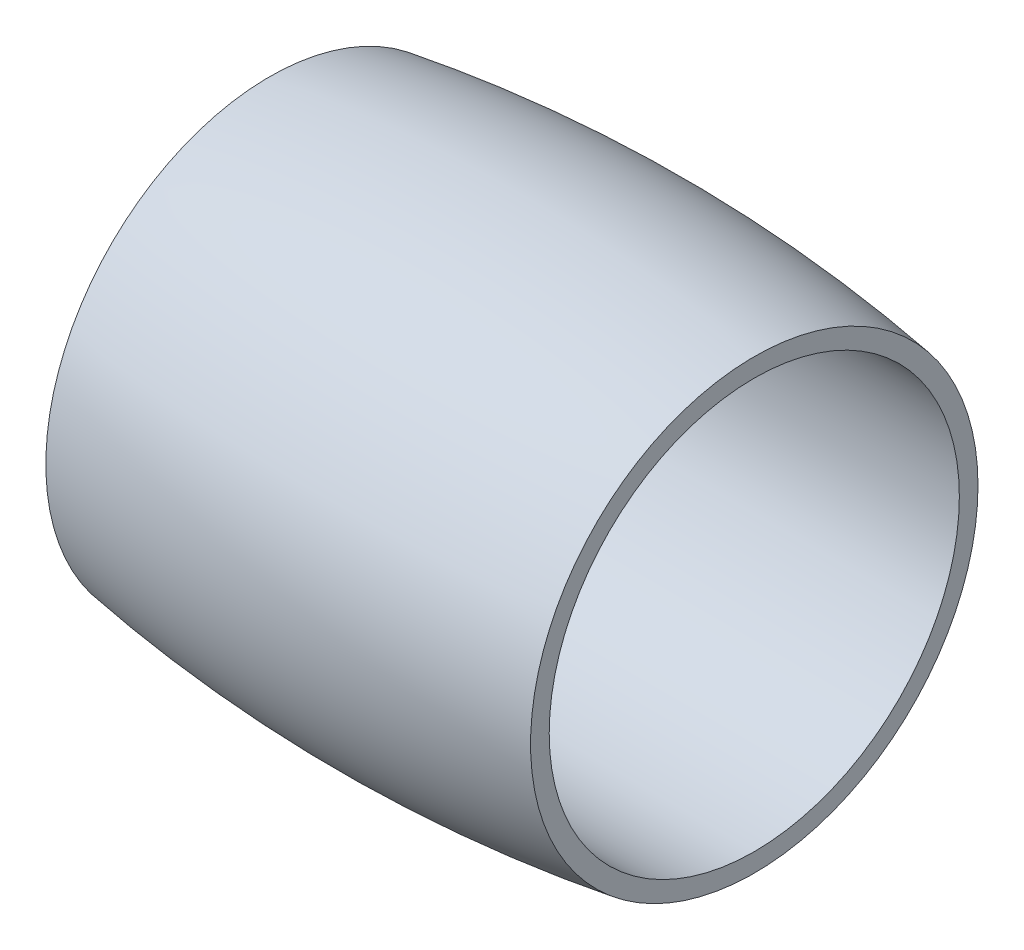
ISO-10303-21;
HEADER;
FILE_DESCRIPTION(('STEP AP214'),'2;1');
FILE_NAME('part.step','',(''),(''),'','','');
FILE_SCHEMA(('AUTOMOTIVE_DESIGN { 1 0 10303 214 1 1 1 1 }'));
ENDSEC;
DATA;
#1=APPLICATION_CONTEXT('core data for automotive mechanical design processes');
#2=APPLICATION_PROTOCOL_DEFINITION('international standard','automotive_design',2000,#1);
#3=PRODUCT_CONTEXT('',#1,'mechanical');
#4=PRODUCT('Part','Part','',(#3));
#5=PRODUCT_RELATED_PRODUCT_CATEGORY('part','',(#4));
#6=PRODUCT_DEFINITION_FORMATION('','',#4);
#7=PRODUCT_DEFINITION_CONTEXT('part definition',#1,'design');
#8=PRODUCT_DEFINITION('design','',#6,#7);
#9=PRODUCT_DEFINITION_SHAPE('','',#8);
#10=(LENGTH_UNIT() NAMED_UNIT(*) SI_UNIT(.MILLI.,.METRE.));
#11=(NAMED_UNIT(*) PLANE_ANGLE_UNIT() SI_UNIT($,.RADIAN.));
#12=(NAMED_UNIT(*) SI_UNIT($,.STERADIAN.) SOLID_ANGLE_UNIT());
#13=UNCERTAINTY_MEASURE_WITH_UNIT(LENGTH_MEASURE(1.E-05),#10,'distance_accuracy_value','');
#14=(GEOMETRIC_REPRESENTATION_CONTEXT(3) GLOBAL_UNCERTAINTY_ASSIGNED_CONTEXT((#13)) GLOBAL_UNIT_ASSIGNED_CONTEXT((#10,
#11,#12)) REPRESENTATION_CONTEXT('',''));
#15=CARTESIAN_POINT('',(0.,0.,0.));
#16=DIRECTION('',(0.,0.,1.));
#17=DIRECTION('',(1.,0.,0.));
#18=AXIS2_PLACEMENT_3D('',#15,#16,#17);
#19=CARTESIAN_POINT('',(-32.5,30.,0.));
#20=DIRECTION('',(-1.,0.,0.));
#21=DIRECTION('',(0.,0.,1.));
#22=AXIS2_PLACEMENT_3D('',#19,#20,#21);
#23=PLANE('',#22);
#24=CARTESIAN_POINT('',(-32.5,0.,0.));
#25=DIRECTION('',(1.,0.,0.));
#26=DIRECTION('',(0.,0.,-1.));
#27=AXIS2_PLACEMENT_3D('',#24,#25,#26);
#28=CIRCLE('',#27,27.5);
#29=CARTESIAN_POINT('',(-32.5,0.,-27.5));
#30=VERTEX_POINT('',#29);
#31=EDGE_CURVE('E45',#30,#30,#28,.T.);
#32=ORIENTED_EDGE('',*,*,#31,.T.);
#33=EDGE_LOOP('',(#32));
#34=FACE_BOUND('',#33,.T.);
#35=CARTESIAN_POINT('',(-32.5,0.,0.));
#36=DIRECTION('',(1.,0.,0.));
#37=DIRECTION('',(0.,0.,-1.));
#38=AXIS2_PLACEMENT_3D('',#35,#36,#37);
#39=CIRCLE('',#38,30.);
#40=CARTESIAN_POINT('',(-32.5,0.,-30.));
#41=VERTEX_POINT('',#40);
#42=EDGE_CURVE('E10',#41,#41,#39,.T.);
#43=ORIENTED_EDGE('',*,*,#42,.F.);
#44=EDGE_LOOP('',(#43));
#45=FACE_BOUND('',#44,.T.);
#46=ADVANCED_FACE('F31',(#34,#45),#23,.T.);
#47=CARTESIAN_POINT('',(0.,0.,0.));
#48=DIRECTION('',(1.,0.,0.));
#49=DIRECTION('',(0.,0.,-1.));
#50=AXIS2_PLACEMENT_3D('',#47,#48,#49);
#51=DEGENERATE_TOROIDAL_SURFACE('',#50,180.,212.5,.F.);
#52=ORIENTED_EDGE('',*,*,#42,.T.);
#53=EDGE_LOOP('',(#52));
#54=FACE_BOUND('',#53,.T.);
#55=CARTESIAN_POINT('',(32.5,0.,0.));
#56=DIRECTION('',(1.,0.,0.));
#57=DIRECTION('',(0.,0.,-1.));
#58=AXIS2_PLACEMENT_3D('',#55,#56,#57);
#59=CIRCLE('',#58,30.);
#60=CARTESIAN_POINT('',(32.5,0.,-30.));
#61=VERTEX_POINT('',#60);
#62=EDGE_CURVE('E37',#61,#61,#59,.T.);
#63=ORIENTED_EDGE('',*,*,#62,.F.);
#64=EDGE_LOOP('',(#63));
#65=FACE_BOUND('',#64,.T.);
#66=ADVANCED_FACE('F61',(#54,#65),#51,.F.);
#67=CARTESIAN_POINT('',(32.5,30.,0.));
#68=DIRECTION('',(1.,0.,0.));
#69=DIRECTION('',(0.,0.,-1.));
#70=AXIS2_PLACEMENT_3D('',#67,#68,#69);
#71=PLANE('',#70);
#72=ORIENTED_EDGE('',*,*,#62,.T.);
#73=EDGE_LOOP('',(#72));
#74=FACE_BOUND('',#73,.T.);
#75=CARTESIAN_POINT('',(32.5,0.,0.));
#76=DIRECTION('',(1.,0.,0.));
#77=DIRECTION('',(0.,0.,-1.));
#78=AXIS2_PLACEMENT_3D('',#75,#76,#77);
#79=CIRCLE('',#78,27.5);
#80=CARTESIAN_POINT('',(32.5,0.,-27.5));
#81=VERTEX_POINT('',#80);
#82=EDGE_CURVE('E41',#81,#81,#79,.T.);
#83=ORIENTED_EDGE('',*,*,#82,.F.);
#84=EDGE_LOOP('',(#83));
#85=FACE_BOUND('',#84,.T.);
#86=ADVANCED_FACE('F55',(#74,#85),#71,.T.);
#87=CARTESIAN_POINT('',(35.75,0.,0.));
#88=DIRECTION('',(1.,0.,0.));
#89=DIRECTION('',(0.,0.,-1.));
#90=AXIS2_PLACEMENT_3D('',#87,#88,#89);
#91=CYLINDRICAL_SURFACE('',#90,27.5);
#92=ORIENTED_EDGE('',*,*,#82,.T.);
#93=EDGE_LOOP('',(#92));
#94=FACE_BOUND('',#93,.T.);
#95=ORIENTED_EDGE('',*,*,#31,.F.);
#96=EDGE_LOOP('',(#95));
#97=FACE_BOUND('',#96,.T.);
#98=ADVANCED_FACE('F53',(#94,#97),#91,.F.);
#99=CLOSED_SHELL('',(#46,#66,#86,#98));
#100=MANIFOLD_SOLID_BREP('B2',#99);
#101=ADVANCED_BREP_SHAPE_REPRESENTATION('',(#18,#100),#14);
#102=SHAPE_DEFINITION_REPRESENTATION(#9,#101);
ENDSEC;
END-ISO-10303-21;
